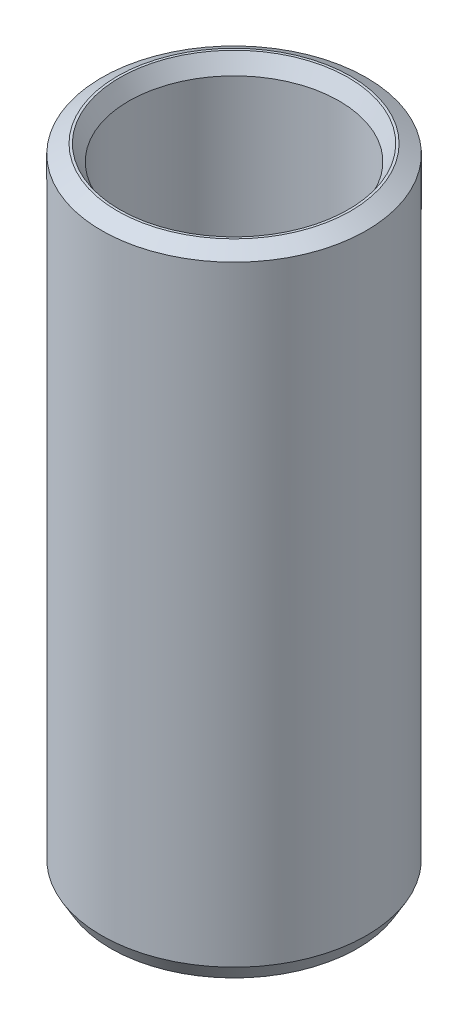
ISO-10303-21;
HEADER;
FILE_DESCRIPTION(('STEP AP214'),'2;1');
FILE_NAME('part.step','',(''),(''),'','','');
FILE_SCHEMA(('AUTOMOTIVE_DESIGN { 1 0 10303 214 1 1 1 1 }'));
ENDSEC;
DATA;
#1=APPLICATION_CONTEXT('core data for automotive mechanical design processes');
#2=APPLICATION_PROTOCOL_DEFINITION('international standard','automotive_design',2000,#1);
#3=PRODUCT_CONTEXT('',#1,'mechanical');
#4=PRODUCT('Part','Part','',(#3));
#5=PRODUCT_RELATED_PRODUCT_CATEGORY('part','',(#4));
#6=PRODUCT_DEFINITION_FORMATION('','',#4);
#7=PRODUCT_DEFINITION_CONTEXT('part definition',#1,'design');
#8=PRODUCT_DEFINITION('design','',#6,#7);
#9=PRODUCT_DEFINITION_SHAPE('','',#8);
#10=(LENGTH_UNIT() NAMED_UNIT(*) SI_UNIT(.MILLI.,.METRE.));
#11=(NAMED_UNIT(*) PLANE_ANGLE_UNIT() SI_UNIT($,.RADIAN.));
#12=(NAMED_UNIT(*) SI_UNIT($,.STERADIAN.) SOLID_ANGLE_UNIT());
#13=UNCERTAINTY_MEASURE_WITH_UNIT(LENGTH_MEASURE(1.E-05),#10,'distance_accuracy_value','');
#14=(GEOMETRIC_REPRESENTATION_CONTEXT(3) GLOBAL_UNCERTAINTY_ASSIGNED_CONTEXT((#13)) GLOBAL_UNIT_ASSIGNED_CONTEXT((#10,
#11,#12)) REPRESENTATION_CONTEXT('',''));
#15=CARTESIAN_POINT('',(0.,0.,0.));
#16=DIRECTION('',(0.,0.,1.));
#17=DIRECTION('',(1.,0.,0.));
#18=AXIS2_PLACEMENT_3D('',#15,#16,#17);
#19=CARTESIAN_POINT('',(0.,119.924512625123,0.));
#20=DIRECTION('',(0.,-1.,0.));
#21=DIRECTION('',(0.,0.,-1.));
#22=AXIS2_PLACEMENT_3D('',#19,#20,#21);
#23=CYLINDRICAL_SURFACE('',#22,25.);
#24=CARTESIAN_POINT('',(0.,2.97037683681976,0.));
#25=DIRECTION('',(0.,1.,0.));
#26=DIRECTION('',(0.,0.,1.));
#27=AXIS2_PLACEMENT_3D('',#24,#25,#26);
#28=CIRCLE('',#27,25.);
#29=CARTESIAN_POINT('',(0.,2.97037683681975,-25.));
#30=VERTEX_POINT('',#29);
#31=EDGE_CURVE('E10',#30,#30,#28,.T.);
#32=CARTESIAN_POINT('',(0.,118.209564758791,0.));
#33=DIRECTION('',(0.,1.,0.));
#34=DIRECTION('',(0.,0.,1.));
#35=AXIS2_PLACEMENT_3D('',#32,#33,#34);
#36=CIRCLE('',#35,25.);
#37=CARTESIAN_POINT('',(0.,118.209564758791,-25.));
#38=VERTEX_POINT('',#37);
#39=EDGE_CURVE('E50',#38,#38,#36,.F.);
#40=CARTESIAN_POINT('',(0.,2.97037683681975,-25.));
#41=CARTESIAN_POINT('',(0.,4.17078504434028,-25.));
#42=CARTESIAN_POINT('',(0.,5.37119325186082,-25.));
#43=CARTESIAN_POINT('',(0.,7.77200966690188,-25.));
#44=CARTESIAN_POINT('',(0.,8.97241787442242,-25.));
#45=CARTESIAN_POINT('',(0.,11.3732342894635,-25.));
#46=CARTESIAN_POINT('',(0.,12.573642496984,-25.));
#47=CARTESIAN_POINT('',(0.,14.9744589120251,-25.));
#48=CARTESIAN_POINT('',(0.,16.1748671195456,-25.));
#49=CARTESIAN_POINT('',(0.,18.5756835345867,-25.));
#50=CARTESIAN_POINT('',(0.,19.7760917421072,-25.));
#51=CARTESIAN_POINT('',(0.,22.1769081571483,-25.));
#52=CARTESIAN_POINT('',(0.,23.3773163646688,-25.));
#53=CARTESIAN_POINT('',(0.,25.7781327797099,-25.));
#54=CARTESIAN_POINT('',(0.,26.9785409872304,-25.));
#55=CARTESIAN_POINT('',(0.,29.3793574022715,-25.));
#56=CARTESIAN_POINT('',(0.,30.579765609792,-25.));
#57=CARTESIAN_POINT('',(0.,32.9805820248331,-25.));
#58=CARTESIAN_POINT('',(0.,34.1809902323536,-25.));
#59=CARTESIAN_POINT('',(0.,36.5818066473947,-25.));
#60=CARTESIAN_POINT('',(0.,37.7822148549152,-25.));
#61=CARTESIAN_POINT('',(0.,40.1830312699563,-25.));
#62=CARTESIAN_POINT('',(0.,41.3834394774768,-25.));
#63=CARTESIAN_POINT('',(0.,43.7842558925179,-25.));
#64=CARTESIAN_POINT('',(0.,44.9846641000384,-25.));
#65=CARTESIAN_POINT('',(0.,47.3854805150795,-25.));
#66=CARTESIAN_POINT('',(0.,48.5858887226,-25.));
#67=CARTESIAN_POINT('',(0.,50.9867051376411,-25.));
#68=CARTESIAN_POINT('',(0.,52.1871133451616,-25.));
#69=CARTESIAN_POINT('',(0.,54.5879297602026,-25.));
#70=CARTESIAN_POINT('',(0.,55.7883379677232,-25.));
#71=CARTESIAN_POINT('',(0.,58.1891543827642,-25.));
#72=CARTESIAN_POINT('',(0.,59.3895625902848,-25.));
#73=CARTESIAN_POINT('',(0.,61.7903790053258,-25.));
#74=CARTESIAN_POINT('',(0.,62.9907872128464,-25.));
#75=CARTESIAN_POINT('',(0.,65.3916036278874,-25.));
#76=CARTESIAN_POINT('',(0.,66.592011835408,-25.));
#77=CARTESIAN_POINT('',(0.,68.992828250449,-25.));
#78=CARTESIAN_POINT('',(0.,70.1932364579696,-25.));
#79=CARTESIAN_POINT('',(0.,72.5940528730106,-25.));
#80=CARTESIAN_POINT('',(0.,73.7944610805311,-25.));
#81=CARTESIAN_POINT('',(0.,76.1952774955722,-25.));
#82=CARTESIAN_POINT('',(0.,77.3956857030928,-25.));
#83=CARTESIAN_POINT('',(0.,79.7965021181338,-25.));
#84=CARTESIAN_POINT('',(0.,80.9969103256544,-25.));
#85=CARTESIAN_POINT('',(0.,83.3977267406954,-25.));
#86=CARTESIAN_POINT('',(0.,84.598134948216,-25.));
#87=CARTESIAN_POINT('',(0.,86.998951363257,-25.));
#88=CARTESIAN_POINT('',(0.,88.1993595707775,-25.));
#89=CARTESIAN_POINT('',(0.,90.6001759858186,-25.));
#90=CARTESIAN_POINT('',(0.,91.8005841933391,-25.));
#91=CARTESIAN_POINT('',(0.,94.2014006083802,-25.));
#92=CARTESIAN_POINT('',(0.,95.4018088159007,-25.));
#93=CARTESIAN_POINT('',(0.,97.8026252309418,-25.));
#94=CARTESIAN_POINT('',(0.,99.0030334384623,-25.));
#95=CARTESIAN_POINT('',(0.,101.403849853503,-25.));
#96=CARTESIAN_POINT('',(0.,102.604258061024,-25.));
#97=CARTESIAN_POINT('',(0.,105.005074476065,-25.));
#98=CARTESIAN_POINT('',(0.,106.205482683586,-25.));
#99=CARTESIAN_POINT('',(0.,108.606299098627,-25.));
#100=CARTESIAN_POINT('',(0.,109.806707306147,-25.));
#101=CARTESIAN_POINT('',(0.,112.207523721188,-25.));
#102=CARTESIAN_POINT('',(0.,113.407931928709,-25.));
#103=CARTESIAN_POINT('',(0.,115.80874834375,-25.));
#104=CARTESIAN_POINT('',(0.,117.00915655127,-25.));
#105=CARTESIAN_POINT('',(0.,118.209564758791,-25.));
#106=B_SPLINE_CURVE_WITH_KNOTS('',3,(#40,#41,#42,#43,#44,#45,#46,#47,#48,#49,#50,#51,#52,#53,
#54,#55,#56,#57,#58,#59,#60,#61,#62,#63,#64,#65,#66,#67,#68,#69,#70,#71,#72,#73,#74,#75,#76,#77,
#78,#79,#80,#81,#82,#83,#84,#85,#86,#87,#88,#89,#90,#91,#92,#93,#94,#95,#96,#97,#98,#99,#100,
#101,#102,#103,#104,#105),.UNSPECIFIED.,.F.,.F.,(4,2,2,2,2,2,2,2,2,2,2,2,2,2,2,2,2,2,2,2,2,2,2,
2,2,2,2,2,2,2,2,2,4),(0.,3.6012246225616,7.2024492451232,10.8036738676848,14.4048984902464,
18.006123112808,21.6073477353696,25.2085723579312,28.8097969804928,32.4110216030544,
36.012246225616,39.6134708481776,43.2146954707392,46.8159200933008,50.4171447158624,
54.018369338424,57.6195939609855,61.2208185835471,64.8220432061087,68.4232678286703,
72.0244924512319,75.6257170737935,79.2269416963551,82.8281663189167,86.4293909414783,
90.0306155640399,93.6318401866015,97.2330648091631,100.834289431725,104.435514054286,
108.036738676848,111.637963299409,115.239187921971),.UNSPECIFIED.);
#107=EDGE_CURVE('BSEAM39',#30,#38,#106,.T.);
#108=ORIENTED_EDGE('',*,*,#31,.T.);
#109=ORIENTED_EDGE('',*,*,#39,.T.);
#110=ORIENTED_EDGE('',*,*,#107,.T.);
#111=ORIENTED_EDGE('',*,*,#107,.F.);
#112=EDGE_LOOP('',(#108,#110,#109,#111));
#113=FACE_BOUND('',#112,.T.);
#114=ADVANCED_FACE('F39',(#113),#23,.T.);
#115=CARTESIAN_POINT('',(0.,119.924512625123,0.));
#116=DIRECTION('',(0.,1.,0.));
#117=DIRECTION('',(0.,0.,1.));
#118=AXIS2_PLACEMENT_3D('',#115,#116,#117);
#119=PLANE('',#118);
#120=CARTESIAN_POINT('',(0.,119.924512625123,0.));
#121=DIRECTION('',(0.,1.,0.));
#122=DIRECTION('',(0.,0.,1.));
#123=AXIS2_PLACEMENT_3D('',#120,#121,#122);
#124=CIRCLE('',#123,21.5827920331576);
#125=CARTESIAN_POINT('',(0.,119.924512625123,21.5827920331576));
#126=VERTEX_POINT('',#125);
#127=EDGE_CURVE('E58',#126,#126,#124,.F.);
#128=ORIENTED_EDGE('',*,*,#127,.T.);
#129=EDGE_LOOP('',(#128));
#130=FACE_BOUND('',#129,.T.);
#131=CARTESIAN_POINT('',(0.,119.924512625123,0.));
#132=DIRECTION('',(0.,1.,0.));
#133=DIRECTION('',(0.,0.,1.));
#134=AXIS2_PLACEMENT_3D('',#131,#132,#133);
#135=CIRCLE('',#134,22.0296231631806);
#136=CARTESIAN_POINT('',(0.,119.924512625123,22.0296231631806));
#137=VERTEX_POINT('',#136);
#138=EDGE_CURVE('E61',#137,#137,#135,.T.);
#139=ORIENTED_EDGE('',*,*,#138,.T.);
#140=EDGE_LOOP('',(#139));
#141=FACE_BOUND('',#140,.T.);
#142=ADVANCED_FACE('F88',(#130,#141),#119,.T.);
#143=CARTESIAN_POINT('',(0.,0.,0.));
#144=DIRECTION('',(0.,1.,0.));
#145=DIRECTION('',(0.,0.,1.));
#146=AXIS2_PLACEMENT_3D('',#143,#144,#145);
#147=PLANE('',#146);
#148=CARTESIAN_POINT('',(0.,0.,0.));
#149=DIRECTION('',(0.,1.,0.));
#150=DIRECTION('',(0.,0.,1.));
#151=AXIS2_PLACEMENT_3D('',#148,#149,#150);
#152=CIRCLE('',#151,22.8382210036446);
#153=CARTESIAN_POINT('',(0.,0.,22.8382210036446));
#154=VERTEX_POINT('',#153);
#155=EDGE_CURVE('E51',#154,#154,#152,.T.);
#156=ORIENTED_EDGE('',*,*,#155,.T.);
#157=EDGE_LOOP('',(#156));
#158=FACE_BOUND('',#157,.T.);
#159=CARTESIAN_POINT('',(0.,0.,0.));
#160=DIRECTION('',(0.,1.,0.));
#161=DIRECTION('',(0.,0.,1.));
#162=AXIS2_PLACEMENT_3D('',#159,#160,#161);
#163=CIRCLE('',#162,23.2850521336675);
#164=CARTESIAN_POINT('',(0.,0.,23.2850521336675));
#165=VERTEX_POINT('',#164);
#166=EDGE_CURVE('E54',#165,#165,#163,.F.);
#167=ORIENTED_EDGE('',*,*,#166,.T.);
#168=EDGE_LOOP('',(#167));
#169=FACE_BOUND('',#168,.T.);
#170=ADVANCED_FACE('F83',(#158,#169),#147,.F.);
#171=CARTESIAN_POINT('',(0.,119.924512625123,0.));
#172=DIRECTION('',(0.,-1.,0.));
#173=DIRECTION('',(0.,0.,-1.));
#174=AXIS2_PLACEMENT_3D('',#171,#172,#173);
#175=CYLINDRICAL_SURFACE('',#174,19.8678441668251);
#176=CARTESIAN_POINT('',(0.,116.954135788304,0.));
#177=DIRECTION('',(0.,1.,0.));
#178=DIRECTION('',(0.,0.,1.));
#179=AXIS2_PLACEMENT_3D('',#176,#177,#178);
#180=CIRCLE('',#179,19.8678441668251);
#181=CARTESIAN_POINT('',(0.,116.954135788304,-19.8678441668251));
#182=VERTEX_POINT('',#181);
#183=EDGE_CURVE('E67',#182,#182,#180,.T.);
#184=CARTESIAN_POINT('',(0.,1.71494786633236,0.));
#185=DIRECTION('',(0.,1.,0.));
#186=DIRECTION('',(0.,0.,1.));
#187=AXIS2_PLACEMENT_3D('',#184,#185,#186);
#188=CIRCLE('',#187,19.8678441668251);
#189=CARTESIAN_POINT('',(0.,1.71494786633236,-19.8678441668251));
#190=VERTEX_POINT('',#189);
#191=EDGE_CURVE('E69',#190,#190,#188,.F.);
#192=CARTESIAN_POINT('',(0.,116.954135788304,-19.8678441668251));
#193=CARTESIAN_POINT('',(0.,115.753727580783,-19.8678441668251));
#194=CARTESIAN_POINT('',(0.,114.553319373262,-19.8678441668251));
#195=CARTESIAN_POINT('',(0.,112.152502958221,-19.8678441668251));
#196=CARTESIAN_POINT('',(0.,110.952094750701,-19.8678441668251));
#197=CARTESIAN_POINT('',(0.,108.55127833566,-19.8678441668251));
#198=CARTESIAN_POINT('',(0.,107.350870128139,-19.8678441668251));
#199=CARTESIAN_POINT('',(0.,104.950053713098,-19.8678441668251));
#200=CARTESIAN_POINT('',(0.,103.749645505578,-19.8678441668251));
#201=CARTESIAN_POINT('',(0.,101.348829090537,-19.8678441668251));
#202=CARTESIAN_POINT('',(0.,100.148420883016,-19.8678441668251));
#203=CARTESIAN_POINT('',(0.,97.747604467975,-19.8678441668251));
#204=CARTESIAN_POINT('',(0.,96.5471962604544,-19.8678441668251));
#205=CARTESIAN_POINT('',(0.,94.1463798454134,-19.8678441668251));
#206=CARTESIAN_POINT('',(0.,92.9459716378928,-19.8678441668251));
#207=CARTESIAN_POINT('',(0.,90.5451552228518,-19.8678441668251));
#208=CARTESIAN_POINT('',(0.,89.3447470153313,-19.8678441668251));
#209=CARTESIAN_POINT('',(0.,86.9439306002902,-19.8678441668251));
#210=CARTESIAN_POINT('',(0.,85.7435223927696,-19.8678441668251));
#211=CARTESIAN_POINT('',(0.,83.3427059777286,-19.8678441668251));
#212=CARTESIAN_POINT('',(0.,82.1422977702081,-19.8678441668251));
#213=CARTESIAN_POINT('',(0.,79.741481355167,-19.8678441668251));
#214=CARTESIAN_POINT('',(0.,78.5410731476465,-19.8678441668251));
#215=CARTESIAN_POINT('',(0.,76.1402567326054,-19.8678441668251));
#216=CARTESIAN_POINT('',(0.,74.9398485250849,-19.8678441668251));
#217=CARTESIAN_POINT('',(0.,72.5390321100438,-19.8678441668251));
#218=CARTESIAN_POINT('',(0.,71.3386239025233,-19.8678441668251));
#219=CARTESIAN_POINT('',(0.,68.9378074874822,-19.8678441668251));
#220=CARTESIAN_POINT('',(0.,67.7373992799617,-19.8678441668251));
#221=CARTESIAN_POINT('',(0.,65.3365828649206,-19.8678441668251));
#222=CARTESIAN_POINT('',(0.,64.1361746574001,-19.8678441668251));
#223=CARTESIAN_POINT('',(0.,61.735358242359,-19.8678441668251));
#224=CARTESIAN_POINT('',(0.,60.5349500348385,-19.8678441668251));
#225=CARTESIAN_POINT('',(0.,58.1341336197974,-19.8678441668251));
#226=CARTESIAN_POINT('',(0.,56.9337254122769,-19.8678441668251));
#227=CARTESIAN_POINT('',(0.,54.5329089972358,-19.8678441668251));
#228=CARTESIAN_POINT('',(0.,53.3325007897153,-19.8678441668251));
#229=CARTESIAN_POINT('',(0.,50.9316843746742,-19.8678441668251));
#230=CARTESIAN_POINT('',(0.,49.7312761671537,-19.8678441668251));
#231=CARTESIAN_POINT('',(0.,47.3304597521126,-19.8678441668251));
#232=CARTESIAN_POINT('',(0.,46.1300515445921,-19.8678441668251));
#233=CARTESIAN_POINT('',(0.,43.729235129551,-19.8678441668251));
#234=CARTESIAN_POINT('',(0.,42.5288269220305,-19.8678441668251));
#235=CARTESIAN_POINT('',(0.,40.1280105069894,-19.8678441668251));
#236=CARTESIAN_POINT('',(0.,38.9276022994689,-19.8678441668251));
#237=CARTESIAN_POINT('',(0.,36.5267858844278,-19.8678441668251));
#238=CARTESIAN_POINT('',(0.,35.3263776769073,-19.8678441668251));
#239=CARTESIAN_POINT('',(0.,32.9255612618662,-19.8678441668251));
#240=CARTESIAN_POINT('',(0.,31.7251530543457,-19.8678441668251));
#241=CARTESIAN_POINT('',(0.,29.3243366393046,-19.8678441668251));
#242=CARTESIAN_POINT('',(0.,28.1239284317841,-19.8678441668251));
#243=CARTESIAN_POINT('',(0.,25.723112016743,-19.8678441668251));
#244=CARTESIAN_POINT('',(0.,24.5227038092225,-19.8678441668251));
#245=CARTESIAN_POINT('',(0.,22.1218873941814,-19.8678441668251));
#246=CARTESIAN_POINT('',(0.,20.9214791866609,-19.8678441668251));
#247=CARTESIAN_POINT('',(0.,18.5206627716198,-19.8678441668251));
#248=CARTESIAN_POINT('',(0.,17.3202545640993,-19.8678441668251));
#249=CARTESIAN_POINT('',(0.,14.9194381490582,-19.8678441668251));
#250=CARTESIAN_POINT('',(0.,13.7190299415377,-19.8678441668251));
#251=CARTESIAN_POINT('',(0.,11.3182135264966,-19.8678441668251));
#252=CARTESIAN_POINT('',(0.,10.1178053189761,-19.8678441668251));
#253=CARTESIAN_POINT('',(0.,7.71698890393503,-19.8678441668251));
#254=CARTESIAN_POINT('',(0.,6.51658069641449,-19.8678441668251));
#255=CARTESIAN_POINT('',(0.,4.11576428137343,-19.8678441668251));
#256=CARTESIAN_POINT('',(0.,2.91535607385289,-19.8678441668251));
#257=CARTESIAN_POINT('',(0.,1.71494786633236,-19.8678441668251));
#258=B_SPLINE_CURVE_WITH_KNOTS('',3,(#192,#193,#194,#195,#196,#197,#198,#199,#200,#201,#202,
#203,#204,#205,#206,#207,#208,#209,#210,#211,#212,#213,#214,#215,#216,#217,#218,#219,#220,#221,
#222,#223,#224,#225,#226,#227,#228,#229,#230,#231,#232,#233,#234,#235,#236,#237,#238,#239,#240,
#241,#242,#243,#244,#245,#246,#247,#248,#249,#250,#251,#252,#253,#254,#255,#256,#257),
.UNSPECIFIED.,.F.,.F.,(4,2,2,2,2,2,2,2,2,2,2,2,2,2,2,2,2,2,2,2,2,2,2,2,2,2,2,2,2,2,2,2,4),(0.,
3.6012246225616,7.2024492451232,10.8036738676848,14.4048984902464,18.006123112808,
21.6073477353696,25.2085723579312,28.8097969804928,32.4110216030544,36.012246225616,
39.6134708481776,43.2146954707392,46.8159200933008,50.4171447158624,54.018369338424,
57.6195939609856,61.2208185835472,64.8220432061088,68.4232678286704,72.024492451232,
75.6257170737936,79.2269416963552,82.8281663189168,86.4293909414783,90.0306155640399,
93.6318401866016,97.2330648091632,100.834289431725,104.435514054286,108.036738676848,
111.63796329941,115.239187921971),.UNSPECIFIED.);
#259=EDGE_CURVE('BSEAM71',#182,#190,#258,.T.);
#260=ORIENTED_EDGE('',*,*,#183,.T.);
#261=ORIENTED_EDGE('',*,*,#191,.T.);
#262=ORIENTED_EDGE('',*,*,#259,.T.);
#263=ORIENTED_EDGE('',*,*,#259,.F.);
#264=EDGE_LOOP('',(#260,#262,#261,#263));
#265=FACE_BOUND('',#264,.T.);
#266=ADVANCED_FACE('F71',(#265),#175,.F.);
#267=CARTESIAN_POINT('',(0.,116.954135788304,0.));
#268=DIRECTION('',(0.,1.,0.));
#269=DIRECTION('',(0.,0.,1.));
#270=AXIS2_PLACEMENT_3D('',#267,#268,#269);
#271=CONICAL_SURFACE('',#270,19.8678441668251,0.523598775598299);
#272=ORIENTED_EDGE('',*,*,#127,.F.);
#273=EDGE_LOOP('',(#272));
#274=FACE_BOUND('',#273,.T.);
#275=ORIENTED_EDGE('',*,*,#183,.F.);
#276=EDGE_LOOP('',(#275));
#277=FACE_BOUND('',#276,.T.);
#278=ADVANCED_FACE('F77',(#274,#277),#271,.F.);
#279=CARTESIAN_POINT('',(0.,0.,0.));
#280=DIRECTION('',(0.,-1.,0.));
#281=DIRECTION('',(0.,0.,-1.));
#282=AXIS2_PLACEMENT_3D('',#279,#280,#281);
#283=CONICAL_SURFACE('',#282,22.8382210036446,1.04719755119659);
#284=ORIENTED_EDGE('',*,*,#191,.F.);
#285=EDGE_LOOP('',(#284));
#286=FACE_BOUND('',#285,.T.);
#287=ORIENTED_EDGE('',*,*,#155,.F.);
#288=EDGE_LOOP('',(#287));
#289=FACE_BOUND('',#288,.T.);
#290=ADVANCED_FACE('F73',(#286,#289),#283,.F.);
#291=CARTESIAN_POINT('',(0.,2.97037683681976,0.));
#292=DIRECTION('',(0.,1.,0.));
#293=DIRECTION('',(0.,0.,1.));
#294=AXIS2_PLACEMENT_3D('',#291,#292,#293);
#295=CONICAL_SURFACE('',#294,25.,0.523598775598304);
#296=ORIENTED_EDGE('',*,*,#166,.F.);
#297=EDGE_LOOP('',(#296));
#298=FACE_BOUND('',#297,.T.);
#299=ORIENTED_EDGE('',*,*,#31,.F.);
#300=EDGE_LOOP('',(#299));
#301=FACE_BOUND('',#300,.T.);
#302=ADVANCED_FACE('F76',(#298,#301),#295,.T.);
#303=CARTESIAN_POINT('',(0.,119.924512625123,0.));
#304=DIRECTION('',(0.,-1.,0.));
#305=DIRECTION('',(0.,0.,-1.));
#306=AXIS2_PLACEMENT_3D('',#303,#304,#305);
#307=CONICAL_SURFACE('',#306,22.0296231631806,1.04719755119659);
#308=ORIENTED_EDGE('',*,*,#39,.F.);
#309=EDGE_LOOP('',(#308));
#310=FACE_BOUND('',#309,.T.);
#311=ORIENTED_EDGE('',*,*,#138,.F.);
#312=EDGE_LOOP('',(#311));
#313=FACE_BOUND('',#312,.T.);
#314=ADVANCED_FACE('F45',(#310,#313),#307,.T.);
#315=CLOSED_SHELL('',(#114,#142,#170,#266,#278,#290,#302,#314));
#316=MANIFOLD_SOLID_BREP('B2',#315);
#317=ADVANCED_BREP_SHAPE_REPRESENTATION('',(#18,#316),#14);
#318=SHAPE_DEFINITION_REPRESENTATION(#9,#317);
ENDSEC;
END-ISO-10303-21;
